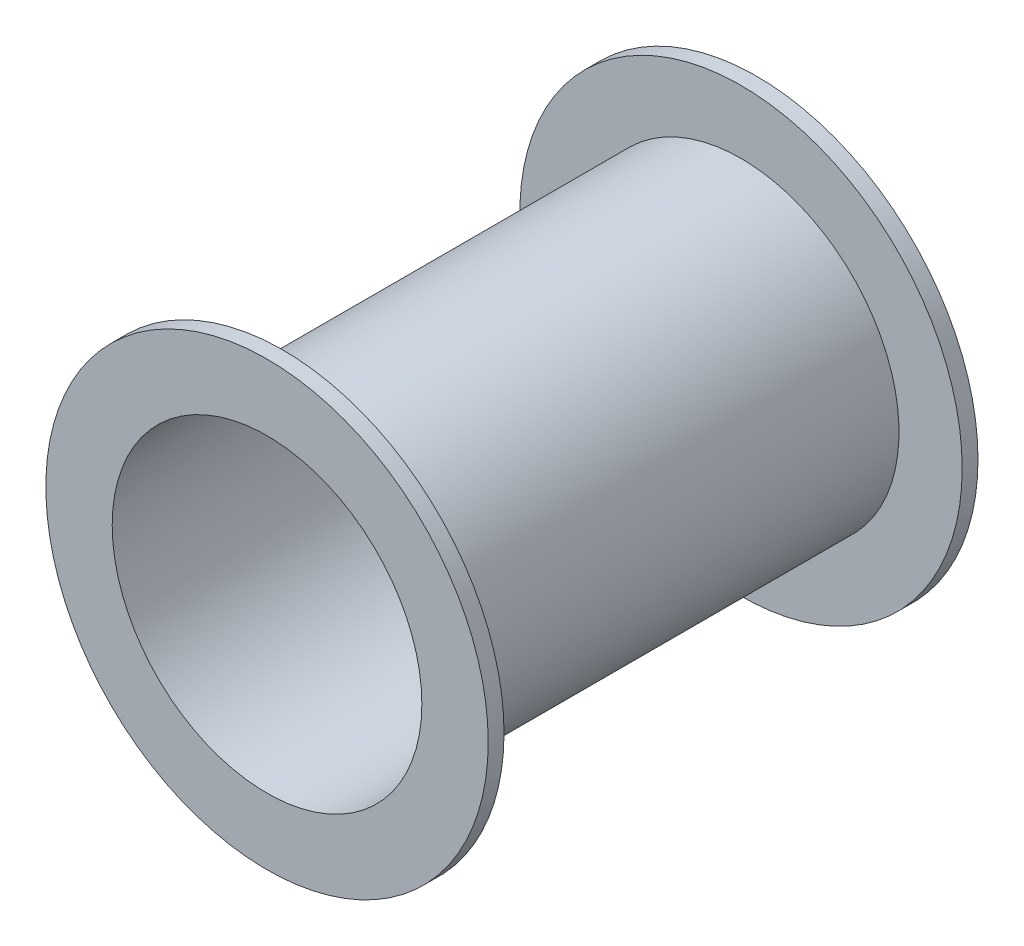
ISO-10303-21;
HEADER;
FILE_DESCRIPTION(('STEP AP214'),'2;1');
FILE_NAME('part.step','',(''),(''),'','','');
FILE_SCHEMA(('AUTOMOTIVE_DESIGN { 1 0 10303 214 1 1 1 1 }'));
ENDSEC;
DATA;
#1=APPLICATION_CONTEXT('core data for automotive mechanical design processes');
#2=APPLICATION_PROTOCOL_DEFINITION('international standard','automotive_design',2000,#1);
#3=PRODUCT_CONTEXT('',#1,'mechanical');
#4=PRODUCT('Part','Part','',(#3));
#5=PRODUCT_RELATED_PRODUCT_CATEGORY('part','',(#4));
#6=PRODUCT_DEFINITION_FORMATION('','',#4);
#7=PRODUCT_DEFINITION_CONTEXT('part definition',#1,'design');
#8=PRODUCT_DEFINITION('design','',#6,#7);
#9=PRODUCT_DEFINITION_SHAPE('','',#8);
#10=(LENGTH_UNIT() NAMED_UNIT(*) SI_UNIT(.MILLI.,.METRE.));
#11=(NAMED_UNIT(*) PLANE_ANGLE_UNIT() SI_UNIT($,.RADIAN.));
#12=(NAMED_UNIT(*) SI_UNIT($,.STERADIAN.) SOLID_ANGLE_UNIT());
#13=UNCERTAINTY_MEASURE_WITH_UNIT(LENGTH_MEASURE(1.E-05),#10,'distance_accuracy_value','');
#14=(GEOMETRIC_REPRESENTATION_CONTEXT(3) GLOBAL_UNCERTAINTY_ASSIGNED_CONTEXT((#13)) GLOBAL_UNIT_ASSIGNED_CONTEXT((#10,
#11,#12)) REPRESENTATION_CONTEXT('',''));
#15=CARTESIAN_POINT('',(0.,0.,0.));
#16=DIRECTION('',(0.,0.,1.));
#17=DIRECTION('',(1.,0.,0.));
#18=AXIS2_PLACEMENT_3D('',#15,#16,#17);
#19=CARTESIAN_POINT('',(0.,0.,310.));
#20=DIRECTION('',(0.,0.,-1.));
#21=DIRECTION('',(-1.,0.,0.));
#22=AXIS2_PLACEMENT_3D('',#19,#20,#21);
#23=CYLINDRICAL_SURFACE('',#22,100.);
#24=CARTESIAN_POINT('',(0.,0.,300.));
#25=DIRECTION('',(0.,0.,1.));
#26=DIRECTION('',(1.,0.,0.));
#27=AXIS2_PLACEMENT_3D('',#24,#25,#26);
#28=CIRCLE('',#27,100.);
#29=CARTESIAN_POINT('',(100.,0.,300.));
#30=VERTEX_POINT('',#29);
#31=EDGE_CURVE('E50',#30,#30,#28,.T.);
#32=ORIENTED_EDGE('',*,*,#31,.F.);
#33=EDGE_LOOP('',(#32));
#34=FACE_BOUND('',#33,.T.);
#35=CARTESIAN_POINT('',(0.,0.,10.));
#36=DIRECTION('',(0.,0.,-1.));
#37=DIRECTION('',(-1.,0.,0.));
#38=AXIS2_PLACEMENT_3D('',#35,#36,#37);
#39=CIRCLE('',#38,100.);
#40=CARTESIAN_POINT('',(-100.,0.,10.));
#41=VERTEX_POINT('',#40);
#42=EDGE_CURVE('E11',#41,#41,#39,.T.);
#43=ORIENTED_EDGE('',*,*,#42,.F.);
#44=EDGE_LOOP('',(#43));
#45=FACE_BOUND('',#44,.T.);
#46=ADVANCED_FACE('F43',(#34,#45),#23,.T.);
#47=CARTESIAN_POINT('',(0.,0.,310.));
#48=DIRECTION('',(0.,0.,1.));
#49=DIRECTION('',(1.,0.,0.));
#50=AXIS2_PLACEMENT_3D('',#47,#48,#49);
#51=PLANE('',#50);
#52=CARTESIAN_POINT('',(0.,0.,310.));
#53=DIRECTION('',(0.,0.,1.));
#54=DIRECTION('',(1.,0.,0.));
#55=AXIS2_PLACEMENT_3D('',#52,#53,#54);
#56=CIRCLE('',#55,98.);
#57=CARTESIAN_POINT('',(98.,0.,310.));
#58=VERTEX_POINT('',#57);
#59=EDGE_CURVE('E55',#58,#58,#56,.T.);
#60=ORIENTED_EDGE('',*,*,#59,.F.);
#61=EDGE_LOOP('',(#60));
#62=FACE_BOUND('',#61,.T.);
#63=CARTESIAN_POINT('',(0.,0.,310.));
#64=DIRECTION('',(0.,0.,1.));
#65=DIRECTION('',(1.,0.,0.));
#66=AXIS2_PLACEMENT_3D('',#63,#64,#65);
#67=CIRCLE('',#66,140.);
#68=CARTESIAN_POINT('',(140.,0.,310.));
#69=VERTEX_POINT('',#68);
#70=EDGE_CURVE('E67',#69,#69,#67,.T.);
#71=ORIENTED_EDGE('',*,*,#70,.T.);
#72=EDGE_LOOP('',(#71));
#73=FACE_BOUND('',#72,.T.);
#74=ADVANCED_FACE('F94',(#62,#73),#51,.T.);
#75=CARTESIAN_POINT('',(0.,0.,0.));
#76=DIRECTION('',(0.,0.,1.));
#77=DIRECTION('',(1.,0.,0.));
#78=AXIS2_PLACEMENT_3D('',#75,#76,#77);
#79=PLANE('',#78);
#80=CARTESIAN_POINT('',(0.,0.,0.));
#81=DIRECTION('',(0.,0.,1.));
#82=DIRECTION('',(1.,0.,0.));
#83=AXIS2_PLACEMENT_3D('',#80,#81,#82);
#84=CIRCLE('',#83,98.);
#85=CARTESIAN_POINT('',(98.,0.,0.));
#86=VERTEX_POINT('',#85);
#87=EDGE_CURVE('E60',#86,#86,#84,.T.);
#88=ORIENTED_EDGE('',*,*,#87,.T.);
#89=EDGE_LOOP('',(#88));
#90=FACE_BOUND('',#89,.T.);
#91=CARTESIAN_POINT('',(0.,0.,0.));
#92=DIRECTION('',(0.,0.,1.));
#93=DIRECTION('',(1.,0.,0.));
#94=AXIS2_PLACEMENT_3D('',#91,#92,#93);
#95=CIRCLE('',#94,140.);
#96=CARTESIAN_POINT('',(140.,0.,0.));
#97=VERTEX_POINT('',#96);
#98=EDGE_CURVE('E75',#97,#97,#95,.T.);
#99=ORIENTED_EDGE('',*,*,#98,.F.);
#100=EDGE_LOOP('',(#99));
#101=FACE_BOUND('',#100,.T.);
#102=ADVANCED_FACE('F91',(#90,#101),#79,.F.);
#103=CARTESIAN_POINT('',(0.,0.,310.));
#104=DIRECTION('',(0.,0.,-1.));
#105=DIRECTION('',(-1.,0.,0.));
#106=AXIS2_PLACEMENT_3D('',#103,#104,#105);
#107=CYLINDRICAL_SURFACE('',#106,98.);
#108=ORIENTED_EDGE('',*,*,#59,.T.);
#109=EDGE_LOOP('',(#108));
#110=FACE_BOUND('',#109,.T.);
#111=ORIENTED_EDGE('',*,*,#87,.F.);
#112=EDGE_LOOP('',(#111));
#113=FACE_BOUND('',#112,.T.);
#114=ADVANCED_FACE('F93',(#110,#113),#107,.F.);
#115=CARTESIAN_POINT('',(0.,0.,300.));
#116=DIRECTION('',(0.,0.,1.));
#117=DIRECTION('',(1.,0.,0.));
#118=AXIS2_PLACEMENT_3D('',#115,#116,#117);
#119=CYLINDRICAL_SURFACE('',#118,140.);
#120=CARTESIAN_POINT('',(0.,0.,300.));
#121=DIRECTION('',(0.,0.,1.));
#122=DIRECTION('',(1.,0.,0.));
#123=AXIS2_PLACEMENT_3D('',#120,#121,#122);
#124=CIRCLE('',#123,140.);
#125=CARTESIAN_POINT('',(140.,0.,300.));
#126=VERTEX_POINT('',#125);
#127=EDGE_CURVE('E65',#126,#126,#124,.T.);
#128=ORIENTED_EDGE('',*,*,#127,.T.);
#129=EDGE_LOOP('',(#128));
#130=FACE_BOUND('',#129,.T.);
#131=ORIENTED_EDGE('',*,*,#70,.F.);
#132=EDGE_LOOP('',(#131));
#133=FACE_BOUND('',#132,.T.);
#134=ADVANCED_FACE('F100',(#130,#133),#119,.T.);
#135=CARTESIAN_POINT('',(0.,0.,300.));
#136=DIRECTION('',(0.,0.,1.));
#137=DIRECTION('',(1.,0.,0.));
#138=AXIS2_PLACEMENT_3D('',#135,#136,#137);
#139=PLANE('',#138);
#140=ORIENTED_EDGE('',*,*,#31,.T.);
#141=EDGE_LOOP('',(#140));
#142=FACE_BOUND('',#141,.T.);
#143=ORIENTED_EDGE('',*,*,#127,.F.);
#144=EDGE_LOOP('',(#143));
#145=FACE_BOUND('',#144,.T.);
#146=ADVANCED_FACE('F127',(#142,#145),#139,.F.);
#147=CARTESIAN_POINT('',(0.,0.,10.));
#148=DIRECTION('',(0.,0.,-1.));
#149=DIRECTION('',(1.,0.,0.));
#150=AXIS2_PLACEMENT_3D('',#147,#148,#149);
#151=PLANE('',#150);
#152=CARTESIAN_POINT('',(0.,0.,10.));
#153=DIRECTION('',(0.,0.,1.));
#154=DIRECTION('',(1.,0.,0.));
#155=AXIS2_PLACEMENT_3D('',#152,#153,#154);
#156=CIRCLE('',#155,140.);
#157=CARTESIAN_POINT('',(140.,0.,10.));
#158=VERTEX_POINT('',#157);
#159=EDGE_CURVE('E71',#158,#158,#156,.T.);
#160=ORIENTED_EDGE('',*,*,#159,.T.);
#161=EDGE_LOOP('',(#160));
#162=FACE_BOUND('',#161,.T.);
#163=ORIENTED_EDGE('',*,*,#42,.T.);
#164=EDGE_LOOP('',(#163));
#165=FACE_BOUND('',#164,.T.);
#166=ADVANCED_FACE('F83',(#162,#165),#151,.F.);
#167=CARTESIAN_POINT('',(0.,0.,10.));
#168=DIRECTION('',(0.,0.,-1.));
#169=DIRECTION('',(-1.,0.,0.));
#170=AXIS2_PLACEMENT_3D('',#167,#168,#169);
#171=CYLINDRICAL_SURFACE('',#170,140.);
#172=ORIENTED_EDGE('',*,*,#159,.F.);
#173=EDGE_LOOP('',(#172));
#174=FACE_BOUND('',#173,.T.);
#175=ORIENTED_EDGE('',*,*,#98,.T.);
#176=EDGE_LOOP('',(#175));
#177=FACE_BOUND('',#176,.T.);
#178=ADVANCED_FACE('F85',(#174,#177),#171,.T.);
#179=CLOSED_SHELL('',(#46,#74,#102,#114,#134,#146,#166,#178));
#180=MANIFOLD_SOLID_BREP('B2',#179);
#181=ADVANCED_BREP_SHAPE_REPRESENTATION('',(#18,#180),#14);
#182=SHAPE_DEFINITION_REPRESENTATION(#9,#181);
ENDSEC;
END-ISO-10303-21;
